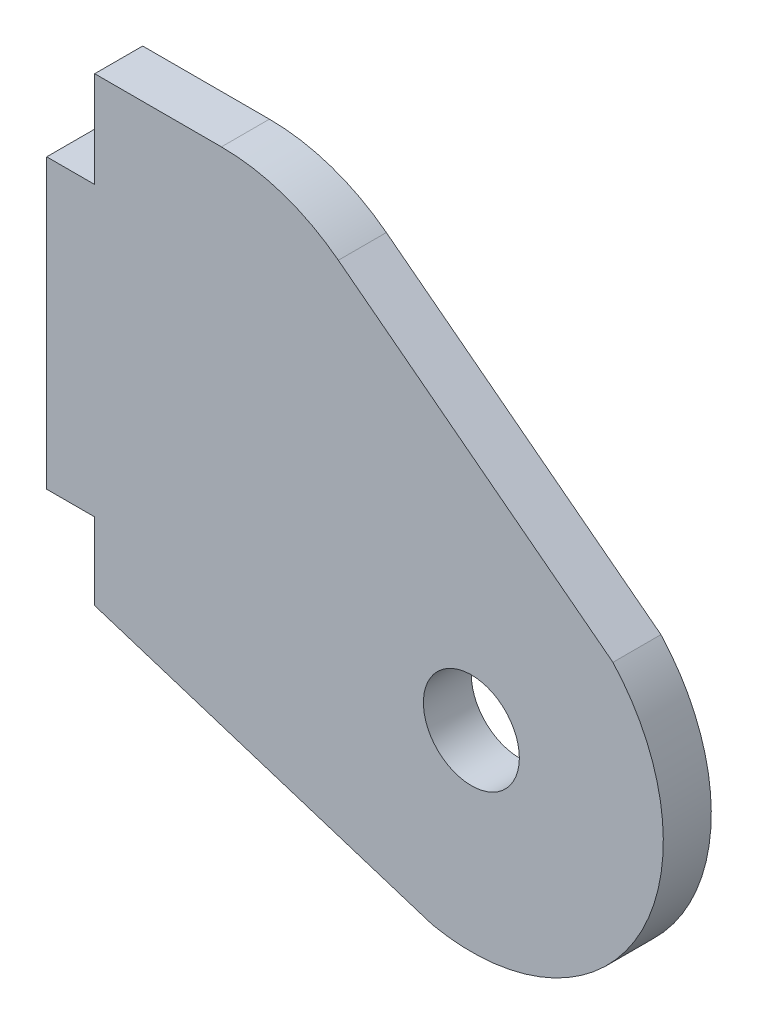
ISO-10303-21;
HEADER;
FILE_DESCRIPTION(('STEP AP214'),'2;1');
FILE_NAME('part.step','',(''),(''),'','','');
FILE_SCHEMA(('AUTOMOTIVE_DESIGN { 1 0 10303 214 1 1 1 1 }'));
ENDSEC;
DATA;
#1=APPLICATION_CONTEXT('core data for automotive mechanical design processes');
#2=APPLICATION_PROTOCOL_DEFINITION('international standard','automotive_design',2000,#1);
#3=PRODUCT_CONTEXT('',#1,'mechanical');
#4=PRODUCT('Part','Part','',(#3));
#5=PRODUCT_RELATED_PRODUCT_CATEGORY('part','',(#4));
#6=PRODUCT_DEFINITION_FORMATION('','',#4);
#7=PRODUCT_DEFINITION_CONTEXT('part definition',#1,'design');
#8=PRODUCT_DEFINITION('design','',#6,#7);
#9=PRODUCT_DEFINITION_SHAPE('','',#8);
#10=(LENGTH_UNIT() NAMED_UNIT(*) SI_UNIT(.MILLI.,.METRE.));
#11=(NAMED_UNIT(*) PLANE_ANGLE_UNIT() SI_UNIT($,.RADIAN.));
#12=(NAMED_UNIT(*) SI_UNIT($,.STERADIAN.) SOLID_ANGLE_UNIT());
#13=UNCERTAINTY_MEASURE_WITH_UNIT(LENGTH_MEASURE(1.E-05),#10,'distance_accuracy_value','');
#14=(GEOMETRIC_REPRESENTATION_CONTEXT(3) GLOBAL_UNCERTAINTY_ASSIGNED_CONTEXT((#13)) GLOBAL_UNIT_ASSIGNED_CONTEXT((#10,
#11,#12)) REPRESENTATION_CONTEXT('',''));
#15=CARTESIAN_POINT('',(0.,0.,0.));
#16=DIRECTION('',(0.,0.,1.));
#17=DIRECTION('',(1.,0.,0.));
#18=AXIS2_PLACEMENT_3D('',#15,#16,#17);
#19=CARTESIAN_POINT('',(-26.2895002274562,-6.08181524735568,3.175));
#20=DIRECTION('',(1.,0.,0.));
#21=DIRECTION('',(0.,0.,-1.));
#22=AXIS2_PLACEMENT_3D('',#19,#20,#21);
#23=PLANE('',#22);
#24=DIRECTION('',(0.,-1.,0.));
#25=VECTOR('',#24,1.);
#26=CARTESIAN_POINT('',(-26.2895002274562,-6.08181524735568,0.));
#27=LINE('',#26,#25);
#28=CARTESIAN_POINT('',(-26.2895002274562,-6.08181524735568,0.));
#29=VERTEX_POINT('',#28);
#30=CARTESIAN_POINT('',(-26.2895002274562,-12.4318152473557,0.));
#31=VERTEX_POINT('',#30);
#32=EDGE_CURVE('E135',#29,#31,#27,.T.);
#33=ORIENTED_EDGE('',*,*,#32,.T.);
#34=DIRECTION('',(0.,0.,-1.));
#35=VECTOR('',#34,1.);
#36=CARTESIAN_POINT('',(-26.2895002274562,-12.4318152473557,3.175));
#37=LINE('',#36,#35);
#38=CARTESIAN_POINT('',(-26.2895002274562,-12.4318152473557,3.175));
#39=VERTEX_POINT('',#38);
#40=EDGE_CURVE('E116',#39,#31,#37,.T.);
#41=ORIENTED_EDGE('',*,*,#40,.F.);
#42=DIRECTION('',(0.,-1.,0.));
#43=VECTOR('',#42,1.);
#44=CARTESIAN_POINT('',(-26.2895002274562,-6.08181524735568,3.175));
#45=LINE('',#44,#43);
#46=CARTESIAN_POINT('',(-26.2895002274562,-6.08181524735568,3.175));
#47=VERTEX_POINT('',#46);
#48=EDGE_CURVE('E123',#47,#39,#45,.T.);
#49=ORIENTED_EDGE('',*,*,#48,.F.);
#50=DIRECTION('',(0.,0.,-1.));
#51=VECTOR('',#50,1.);
#52=CARTESIAN_POINT('',(-26.2895002274562,-6.08181524735568,3.175));
#53=LINE('',#52,#51);
#54=EDGE_CURVE('E158',#47,#29,#53,.T.);
#55=ORIENTED_EDGE('',*,*,#54,.T.);
#56=EDGE_LOOP('',(#33,#41,#49,#55));
#57=FACE_BOUND('',#56,.T.);
#58=ADVANCED_FACE('F35',(#57),#23,.F.);
#59=CARTESIAN_POINT('',(-29.4645002274562,-12.4318152473557,3.175));
#60=DIRECTION('',(0.,-1.,0.));
#61=DIRECTION('',(0.,0.,-1.));
#62=AXIS2_PLACEMENT_3D('',#59,#60,#61);
#63=PLANE('',#62);
#64=DIRECTION('',(-1.,0.,0.));
#65=VECTOR('',#64,1.);
#66=CARTESIAN_POINT('',(-29.4645002274562,-12.4318152473557,0.));
#67=LINE('',#66,#65);
#68=CARTESIAN_POINT('',(-29.4645002274562,-12.4318152473557,0.));
#69=VERTEX_POINT('',#68);
#70=EDGE_CURVE('E173',#31,#69,#67,.T.);
#71=ORIENTED_EDGE('',*,*,#70,.T.);
#72=DIRECTION('',(0.,0.,-1.));
#73=VECTOR('',#72,1.);
#74=CARTESIAN_POINT('',(-29.4645002274562,-12.4318152473557,3.175));
#75=LINE('',#74,#73);
#76=CARTESIAN_POINT('',(-29.4645002274562,-12.4318152473557,3.175));
#77=VERTEX_POINT('',#76);
#78=EDGE_CURVE('E119',#77,#69,#75,.T.);
#79=ORIENTED_EDGE('',*,*,#78,.F.);
#80=DIRECTION('',(-1.,0.,0.));
#81=VECTOR('',#80,1.);
#82=CARTESIAN_POINT('',(-29.4645002274562,-12.4318152473557,3.175));
#83=LINE('',#82,#81);
#84=EDGE_CURVE('E112',#39,#77,#83,.T.);
#85=ORIENTED_EDGE('',*,*,#84,.F.);
#86=ORIENTED_EDGE('',*,*,#40,.T.);
#87=EDGE_LOOP('',(#71,#79,#85,#86));
#88=FACE_BOUND('',#87,.T.);
#89=ADVANCED_FACE('F114',(#88),#63,.F.);
#90=CARTESIAN_POINT('',(-29.4645002274562,-31.4818152473557,3.175));
#91=DIRECTION('',(1.,0.,0.));
#92=DIRECTION('',(0.,0.,-1.));
#93=AXIS2_PLACEMENT_3D('',#90,#91,#92);
#94=PLANE('',#93);
#95=DIRECTION('',(0.,-1.,0.));
#96=VECTOR('',#95,1.);
#97=CARTESIAN_POINT('',(-29.4645002274562,-31.4818152473557,0.));
#98=LINE('',#97,#96);
#99=CARTESIAN_POINT('',(-29.4645002274562,-31.4818152473557,0.));
#100=VERTEX_POINT('',#99);
#101=EDGE_CURVE('E171',#69,#100,#98,.T.);
#102=ORIENTED_EDGE('',*,*,#101,.T.);
#103=DIRECTION('',(0.,0.,-1.));
#104=VECTOR('',#103,1.);
#105=CARTESIAN_POINT('',(-29.4645002274562,-31.4818152473557,3.175));
#106=LINE('',#105,#104);
#107=CARTESIAN_POINT('',(-29.4645002274562,-31.4818152473557,3.175));
#108=VERTEX_POINT('',#107);
#109=EDGE_CURVE('E140',#108,#100,#106,.T.);
#110=ORIENTED_EDGE('',*,*,#109,.F.);
#111=DIRECTION('',(0.,-1.,0.));
#112=VECTOR('',#111,1.);
#113=CARTESIAN_POINT('',(-29.4645002274562,-31.4818152473557,3.175));
#114=LINE('',#113,#112);
#115=EDGE_CURVE('E122',#77,#108,#114,.T.);
#116=ORIENTED_EDGE('',*,*,#115,.F.);
#117=ORIENTED_EDGE('',*,*,#78,.T.);
#118=EDGE_LOOP('',(#102,#110,#116,#117));
#119=FACE_BOUND('',#118,.T.);
#120=ADVANCED_FACE('F215',(#119),#94,.F.);
#121=CARTESIAN_POINT('',(-26.2895002274562,-31.4818152473557,3.175));
#122=DIRECTION('',(0.,1.,0.));
#123=DIRECTION('',(0.,0.,1.));
#124=AXIS2_PLACEMENT_3D('',#121,#122,#123);
#125=PLANE('',#124);
#126=DIRECTION('',(1.,0.,0.));
#127=VECTOR('',#126,1.);
#128=CARTESIAN_POINT('',(-26.2895002274562,-31.4818152473557,0.));
#129=LINE('',#128,#127);
#130=CARTESIAN_POINT('',(-26.2895002274562,-31.4818152473557,0.));
#131=VERTEX_POINT('',#130);
#132=EDGE_CURVE('E169',#100,#131,#129,.T.);
#133=ORIENTED_EDGE('',*,*,#132,.T.);
#134=DIRECTION('',(0.,0.,-1.));
#135=VECTOR('',#134,1.);
#136=CARTESIAN_POINT('',(-26.2895002274562,-31.4818152473557,3.175));
#137=LINE('',#136,#135);
#138=CARTESIAN_POINT('',(-26.2895002274562,-31.4818152473557,3.175));
#139=VERTEX_POINT('',#138);
#140=EDGE_CURVE('E146',#139,#131,#137,.T.);
#141=ORIENTED_EDGE('',*,*,#140,.F.);
#142=DIRECTION('',(1.,0.,0.));
#143=VECTOR('',#142,1.);
#144=CARTESIAN_POINT('',(-26.2895002274562,-31.4818152473557,3.175));
#145=LINE('',#144,#143);
#146=EDGE_CURVE('E186',#108,#139,#145,.T.);
#147=ORIENTED_EDGE('',*,*,#146,.F.);
#148=ORIENTED_EDGE('',*,*,#109,.T.);
#149=EDGE_LOOP('',(#133,#141,#147,#148));
#150=FACE_BOUND('',#149,.T.);
#151=ADVANCED_FACE('F220',(#150),#125,.F.);
#152=CARTESIAN_POINT('',(-26.2895002274562,-31.4818152473557,3.175));
#153=DIRECTION('',(1.,0.,0.));
#154=DIRECTION('',(0.,1.,0.));
#155=AXIS2_PLACEMENT_3D('',#152,#153,#154);
#156=PLANE('',#155);
#157=DIRECTION('',(0.,-1.,0.));
#158=VECTOR('',#157,1.);
#159=CARTESIAN_POINT('',(-26.2895002274562,-31.4818152473557,0.));
#160=LINE('',#159,#158);
#161=CARTESIAN_POINT('',(-26.2895002274562,-36.5618152473557,0.));
#162=VERTEX_POINT('',#161);
#163=EDGE_CURVE('E167',#131,#162,#160,.T.);
#164=ORIENTED_EDGE('',*,*,#163,.T.);
#165=DIRECTION('',(0.,0.,-1.));
#166=VECTOR('',#165,1.);
#167=CARTESIAN_POINT('',(-26.2895002274562,-36.5618152473557,3.175));
#168=LINE('',#167,#166);
#169=CARTESIAN_POINT('',(-26.2895002274562,-36.5618152473557,3.175));
#170=VERTEX_POINT('',#169);
#171=EDGE_CURVE('E149',#170,#162,#168,.T.);
#172=ORIENTED_EDGE('',*,*,#171,.F.);
#173=DIRECTION('',(0.,-1.,0.));
#174=VECTOR('',#173,1.);
#175=CARTESIAN_POINT('',(-26.2895002274562,-31.4818152473557,3.175));
#176=LINE('',#175,#174);
#177=EDGE_CURVE('E184',#139,#170,#176,.T.);
#178=ORIENTED_EDGE('',*,*,#177,.F.);
#179=ORIENTED_EDGE('',*,*,#140,.T.);
#180=EDGE_LOOP('',(#164,#172,#178,#179));
#181=FACE_BOUND('',#180,.T.);
#182=ADVANCED_FACE('F224',(#181),#156,.F.);
#183=CARTESIAN_POINT('',(-26.2895002274562,-36.5618152473557,3.175));
#184=DIRECTION('',(0.303441198287286,0.952850166176181,0.));
#185=DIRECTION('',(-0.952850166176181,0.303441198287286,0.));
#186=AXIS2_PLACEMENT_3D('',#183,#184,#185);
#187=PLANE('',#186);
#188=DIRECTION('',(0.952850166176181,-0.303441198287286,0.));
#189=VECTOR('',#188,1.);
#190=CARTESIAN_POINT('',(-26.2895002274562,-36.5618152473557,0.));
#191=LINE('',#190,#189);
#192=CARTESIAN_POINT('',(-3.93750022745617,-43.6799518703841,0.));
#193=VERTEX_POINT('',#192);
#194=EDGE_CURVE('E165',#162,#193,#191,.T.);
#195=ORIENTED_EDGE('',*,*,#194,.T.);
#196=DIRECTION('',(0.,0.,-1.));
#197=VECTOR('',#196,1.);
#198=CARTESIAN_POINT('',(-3.93750022745617,-43.6799518703841,3.175));
#199=LINE('',#198,#197);
#200=CARTESIAN_POINT('',(-3.93750022745617,-43.6799518703841,3.175));
#201=VERTEX_POINT('',#200);
#202=EDGE_CURVE('E152',#201,#193,#199,.T.);
#203=ORIENTED_EDGE('',*,*,#202,.F.);
#204=DIRECTION('',(0.952850166176181,-0.303441198287286,0.));
#205=VECTOR('',#204,1.);
#206=CARTESIAN_POINT('',(-26.2895002274562,-36.5618152473557,3.175));
#207=LINE('',#206,#205);
#208=EDGE_CURVE('E182',#170,#201,#207,.T.);
#209=ORIENTED_EDGE('',*,*,#208,.F.);
#210=ORIENTED_EDGE('',*,*,#171,.T.);
#211=EDGE_LOOP('',(#195,#203,#209,#210));
#212=FACE_BOUND('',#211,.T.);
#213=ADVANCED_FACE('F228',(#212),#187,.F.);
#214=CARTESIAN_POINT('',(-1.36575022745629,-31.2430671343459,3.175));
#215=DIRECTION('',(0.,0.,-1.));
#216=DIRECTION('',(-1.,0.,0.));
#217=AXIS2_PLACEMENT_3D('',#214,#215,#216);
#218=CYLINDRICAL_SURFACE('',#217,12.7);
#219=CARTESIAN_POINT('',(-1.36575022745629,-31.2430671343459,0.));
#220=DIRECTION('',(0.,0.,1.));
#221=DIRECTION('',(-1.,0.,0.));
#222=AXIS2_PLACEMENT_3D('',#219,#220,#221);
#223=CIRCLE('',#222,12.7);
#224=CARTESIAN_POINT('',(8.00049977254384,-22.6661585457286,0.));
#225=VERTEX_POINT('',#224);
#226=EDGE_CURVE('E163',#193,#225,#223,.T.);
#227=ORIENTED_EDGE('',*,*,#226,.T.);
#228=DIRECTION('',(0.,0.,-1.));
#229=VECTOR('',#228,1.);
#230=CARTESIAN_POINT('',(8.00049977254384,-22.6661585457286,3.175));
#231=LINE('',#230,#229);
#232=CARTESIAN_POINT('',(8.00049977254384,-22.6661585457286,3.175));
#233=VERTEX_POINT('',#232);
#234=EDGE_CURVE('E155',#233,#225,#231,.T.);
#235=ORIENTED_EDGE('',*,*,#234,.F.);
#236=CARTESIAN_POINT('',(-1.36575022745629,-31.2430671343459,3.175));
#237=DIRECTION('',(0.,0.,1.));
#238=DIRECTION('',(-1.,0.,0.));
#239=AXIS2_PLACEMENT_3D('',#236,#237,#238);
#240=CIRCLE('',#239,12.7);
#241=EDGE_CURVE('E180',#201,#233,#240,.T.);
#242=ORIENTED_EDGE('',*,*,#241,.F.);
#243=ORIENTED_EDGE('',*,*,#202,.T.);
#244=EDGE_LOOP('',(#227,#235,#242,#243));
#245=FACE_BOUND('',#244,.T.);
#246=ADVANCED_FACE('F232',(#245),#218,.T.);
#247=CARTESIAN_POINT('',(-13.5895002274562,-6.08181524735568,3.175));
#248=DIRECTION('',(-0.609171799118422,-0.793038283539215,0.));
#249=DIRECTION('',(0.793038283539216,-0.609171799118422,0.));
#250=AXIS2_PLACEMENT_3D('',#247,#248,#249);
#251=PLANE('',#250);
#252=DIRECTION('',(-0.793038283539215,0.609171799118422,0.));
#253=VECTOR('',#252,1.);
#254=CARTESIAN_POINT('',(-13.5895002274562,-6.08181524735568,0.));
#255=LINE('',#254,#253);
#256=CARTESIAN_POINT('',(-10.1677515998153,-8.71022904640765,0.));
#257=VERTEX_POINT('',#256);
#258=EDGE_CURVE('E161',#225,#257,#255,.T.);
#259=ORIENTED_EDGE('',*,*,#258,.T.);
#260=DIRECTION('',(0.,0.,-1.));
#261=VECTOR('',#260,1.);
#262=CARTESIAN_POINT('',(-10.1677515998153,-8.71022904640765,3.175));
#263=LINE('',#262,#261);
#264=CARTESIAN_POINT('',(-10.1677515998153,-8.71022904640765,3.175));
#265=VERTEX_POINT('',#264);
#266=EDGE_CURVE('E43',#257,#265,#263,.F.);
#267=ORIENTED_EDGE('',*,*,#266,.T.);
#268=DIRECTION('',(-0.793038283539215,0.609171799118422,0.));
#269=VECTOR('',#268,1.);
#270=CARTESIAN_POINT('',(-13.5895002274562,-6.08181524735568,3.175));
#271=LINE('',#270,#269);
#272=EDGE_CURVE('E178',#233,#265,#271,.T.);
#273=ORIENTED_EDGE('',*,*,#272,.F.);
#274=ORIENTED_EDGE('',*,*,#234,.T.);
#275=EDGE_LOOP('',(#259,#267,#273,#274));
#276=FACE_BOUND('',#275,.T.);
#277=ADVANCED_FACE('F207',(#276),#251,.F.);
#278=CARTESIAN_POINT('',(-26.2895002274562,-6.08181524735568,3.175));
#279=DIRECTION('',(0.,-1.,0.));
#280=DIRECTION('',(0.,0.,-1.));
#281=AXIS2_PLACEMENT_3D('',#278,#279,#280);
#282=PLANE('',#281);
#283=DIRECTION('',(-1.,0.,0.));
#284=VECTOR('',#283,1.);
#285=CARTESIAN_POINT('',(-26.2895002274562,-6.08181524735568,3.175));
#286=LINE('',#285,#284);
#287=CARTESIAN_POINT('',(-17.9042334486193,-6.08181524735568,3.175));
#288=VERTEX_POINT('',#287);
#289=EDGE_CURVE('E128',#288,#47,#286,.T.);
#290=ORIENTED_EDGE('',*,*,#289,.F.);
#291=DIRECTION('',(0.,0.,-1.));
#292=VECTOR('',#291,1.);
#293=CARTESIAN_POINT('',(-17.9042334486193,-6.08181524735568,3.175));
#294=LINE('',#293,#292);
#295=CARTESIAN_POINT('',(-17.9042334486193,-6.08181524735568,0.));
#296=VERTEX_POINT('',#295);
#297=EDGE_CURVE('E136',#288,#296,#294,.T.);
#298=ORIENTED_EDGE('',*,*,#297,.T.);
#299=DIRECTION('',(-1.,0.,0.));
#300=VECTOR('',#299,1.);
#301=CARTESIAN_POINT('',(-26.2895002274562,-6.08181524735568,0.));
#302=LINE('',#301,#300);
#303=EDGE_CURVE('E132',#296,#29,#302,.T.);
#304=ORIENTED_EDGE('',*,*,#303,.T.);
#305=ORIENTED_EDGE('',*,*,#54,.F.);
#306=EDGE_LOOP('',(#290,#298,#304,#305));
#307=FACE_BOUND('',#306,.T.);
#308=ADVANCED_FACE('F199',(#307),#282,.F.);
#309=CARTESIAN_POINT('',(-1.36575022745629,-31.2430671343459,3.175));
#310=DIRECTION('',(0.,0.,-1.));
#311=DIRECTION('',(-1.,0.,0.));
#312=AXIS2_PLACEMENT_3D('',#309,#310,#311);
#313=PLANE('',#312);
#314=CARTESIAN_POINT('',(-1.36575022745629,-31.2430671343459,3.175));
#315=DIRECTION('',(0.,0.,1.));
#316=DIRECTION('',(1.,0.,0.));
#317=AXIS2_PLACEMENT_3D('',#314,#315,#316);
#318=CIRCLE('',#317,3.175);
#319=CARTESIAN_POINT('',(1.80924977254371,-31.2430671343459,3.175));
#320=VERTEX_POINT('',#319);
#321=EDGE_CURVE('E191',#320,#320,#318,.T.);
#322=ORIENTED_EDGE('',*,*,#321,.F.);
#323=EDGE_LOOP('',(#322));
#324=FACE_BOUND('',#323,.T.);
#325=ORIENTED_EDGE('',*,*,#272,.T.);
#326=CARTESIAN_POINT('',(-17.9042334486193,-18.7818152473557,3.175));
#327=DIRECTION('',(0.,0.,-1.));
#328=DIRECTION('',(-1.,0.,0.));
#329=AXIS2_PLACEMENT_3D('',#326,#327,#328);
#330=CIRCLE('',#329,12.7);
#331=EDGE_CURVE('E11',#265,#288,#330,.F.);
#332=ORIENTED_EDGE('',*,*,#331,.T.);
#333=ORIENTED_EDGE('',*,*,#289,.T.);
#334=ORIENTED_EDGE('',*,*,#48,.T.);
#335=ORIENTED_EDGE('',*,*,#84,.T.);
#336=ORIENTED_EDGE('',*,*,#115,.T.);
#337=ORIENTED_EDGE('',*,*,#146,.T.);
#338=ORIENTED_EDGE('',*,*,#177,.T.);
#339=ORIENTED_EDGE('',*,*,#208,.T.);
#340=ORIENTED_EDGE('',*,*,#241,.T.);
#341=EDGE_LOOP('',(#325,#332,#333,#334,#335,#336,#337,#338,#339,#340));
#342=FACE_BOUND('',#341,.T.);
#343=ADVANCED_FACE('F126',(#324,#342),#313,.F.);
#344=CARTESIAN_POINT('',(-1.36575022745629,-31.2430671343459,0.));
#345=DIRECTION('',(0.,0.,-1.));
#346=DIRECTION('',(-1.,0.,0.));
#347=AXIS2_PLACEMENT_3D('',#344,#345,#346);
#348=PLANE('',#347);
#349=CARTESIAN_POINT('',(-1.36575022745629,-31.2430671343459,0.));
#350=DIRECTION('',(0.,0.,-1.));
#351=DIRECTION('',(-1.,0.,0.));
#352=AXIS2_PLACEMENT_3D('',#349,#350,#351);
#353=CIRCLE('',#352,3.175);
#354=CARTESIAN_POINT('',(-4.54075022745629,-31.2430671343459,0.));
#355=VERTEX_POINT('',#354);
#356=EDGE_CURVE('E176',#355,#355,#353,.T.);
#357=ORIENTED_EDGE('',*,*,#356,.F.);
#358=EDGE_LOOP('',(#357));
#359=FACE_BOUND('',#358,.T.);
#360=ORIENTED_EDGE('',*,*,#303,.F.);
#361=CARTESIAN_POINT('',(-17.9042334486193,-18.7818152473557,0.));
#362=DIRECTION('',(0.,0.,-1.));
#363=DIRECTION('',(-1.,0.,0.));
#364=AXIS2_PLACEMENT_3D('',#361,#362,#363);
#365=CIRCLE('',#364,12.7);
#366=EDGE_CURVE('E57',#296,#257,#365,.T.);
#367=ORIENTED_EDGE('',*,*,#366,.T.);
#368=ORIENTED_EDGE('',*,*,#258,.F.);
#369=ORIENTED_EDGE('',*,*,#226,.F.);
#370=ORIENTED_EDGE('',*,*,#194,.F.);
#371=ORIENTED_EDGE('',*,*,#163,.F.);
#372=ORIENTED_EDGE('',*,*,#132,.F.);
#373=ORIENTED_EDGE('',*,*,#101,.F.);
#374=ORIENTED_EDGE('',*,*,#70,.F.);
#375=ORIENTED_EDGE('',*,*,#32,.F.);
#376=EDGE_LOOP('',(#360,#367,#368,#369,#370,#371,#372,#373,#374,#375));
#377=FACE_BOUND('',#376,.T.);
#378=ADVANCED_FACE('F198',(#359,#377),#348,.T.);
#379=CARTESIAN_POINT('',(-1.36575022745629,-31.2430671343459,3.175));
#380=DIRECTION('',(0.,0.,1.));
#381=DIRECTION('',(1.,0.,0.));
#382=AXIS2_PLACEMENT_3D('',#379,#380,#381);
#383=CYLINDRICAL_SURFACE('',#382,3.175);
#384=ORIENTED_EDGE('',*,*,#356,.T.);
#385=EDGE_LOOP('',(#384));
#386=FACE_BOUND('',#385,.T.);
#387=ORIENTED_EDGE('',*,*,#321,.T.);
#388=EDGE_LOOP('',(#387));
#389=FACE_BOUND('',#388,.T.);
#390=ADVANCED_FACE('F195',(#386,#389),#383,.F.);
#391=CARTESIAN_POINT('',(-17.9042334486193,-18.7818152473557,3.175));
#392=DIRECTION('',(0.,0.,-1.));
#393=DIRECTION('',(-1.,0.,0.));
#394=AXIS2_PLACEMENT_3D('',#391,#392,#393);
#395=CYLINDRICAL_SURFACE('',#394,12.7);
#396=ORIENTED_EDGE('',*,*,#331,.F.);
#397=ORIENTED_EDGE('',*,*,#266,.F.);
#398=ORIENTED_EDGE('',*,*,#366,.F.);
#399=ORIENTED_EDGE('',*,*,#297,.F.);
#400=EDGE_LOOP('',(#396,#397,#398,#399));
#401=FACE_BOUND('',#400,.T.);
#402=ADVANCED_FACE('F37',(#401),#395,.T.);
#403=CLOSED_SHELL('',(#58,#89,#120,#151,#182,#213,#246,#277,#308,#343,#378,#390,#402));
#404=MANIFOLD_SOLID_BREP('B2',#403);
#405=ADVANCED_BREP_SHAPE_REPRESENTATION('',(#18,#404),#14);
#406=SHAPE_DEFINITION_REPRESENTATION(#9,#405);
ENDSEC;
END-ISO-10303-21;
